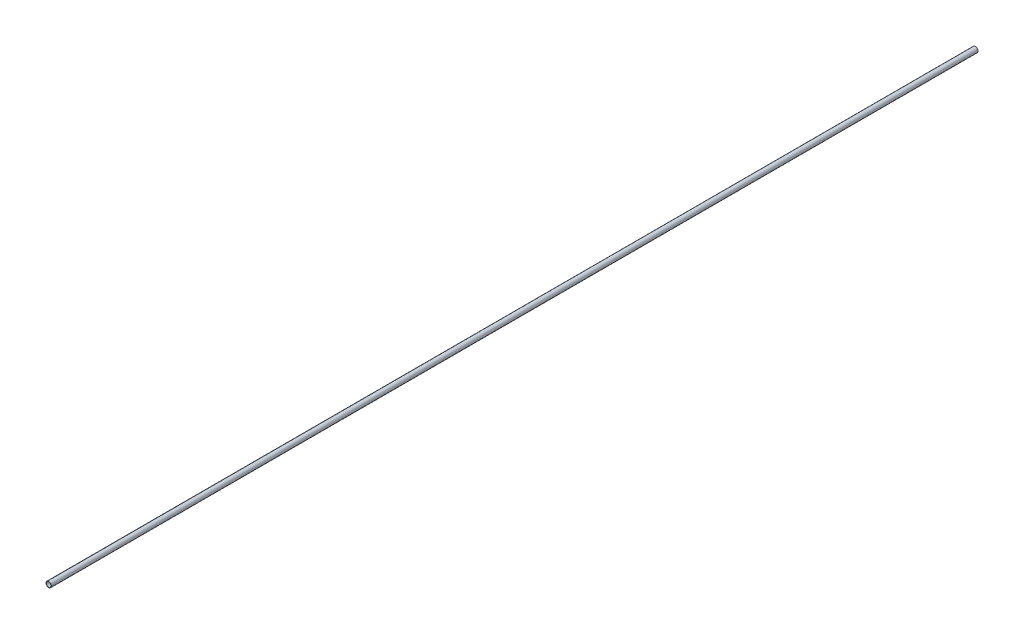
ISO-10303-21;
HEADER;
FILE_DESCRIPTION(('STEP AP214'),'2;1');
FILE_NAME('part.step','',(''),(''),'','','');
FILE_SCHEMA(('AUTOMOTIVE_DESIGN { 1 0 10303 214 1 1 1 1 }'));
ENDSEC;
DATA;
#1=APPLICATION_CONTEXT('core data for automotive mechanical design processes');
#2=APPLICATION_PROTOCOL_DEFINITION('international standard','automotive_design',2000,#1);
#3=PRODUCT_CONTEXT('',#1,'mechanical');
#4=PRODUCT('Part','Part','',(#3));
#5=PRODUCT_RELATED_PRODUCT_CATEGORY('part','',(#4));
#6=PRODUCT_DEFINITION_FORMATION('','',#4);
#7=PRODUCT_DEFINITION_CONTEXT('part definition',#1,'design');
#8=PRODUCT_DEFINITION('design','',#6,#7);
#9=PRODUCT_DEFINITION_SHAPE('','',#8);
#10=(LENGTH_UNIT() NAMED_UNIT(*) SI_UNIT(.MILLI.,.METRE.));
#11=(NAMED_UNIT(*) PLANE_ANGLE_UNIT() SI_UNIT($,.RADIAN.));
#12=(NAMED_UNIT(*) SI_UNIT($,.STERADIAN.) SOLID_ANGLE_UNIT());
#13=UNCERTAINTY_MEASURE_WITH_UNIT(LENGTH_MEASURE(1.E-05),#10,'distance_accuracy_value','');
#14=(GEOMETRIC_REPRESENTATION_CONTEXT(3) GLOBAL_UNCERTAINTY_ASSIGNED_CONTEXT((#13)) GLOBAL_UNIT_ASSIGNED_CONTEXT((#10,
#11,#12)) REPRESENTATION_CONTEXT('',''));
#15=CARTESIAN_POINT('',(0.,0.,0.));
#16=DIRECTION('',(0.,0.,1.));
#17=DIRECTION('',(1.,0.,0.));
#18=AXIS2_PLACEMENT_3D('',#15,#16,#17);
#19=CARTESIAN_POINT('',(0.,0.,2190.75));
#20=DIRECTION('',(0.,0.,1.));
#21=DIRECTION('',(1.,0.,0.));
#22=AXIS2_PLACEMENT_3D('',#19,#20,#21);
#23=PLANE('',#22);
#24=CARTESIAN_POINT('',(0.,0.,2190.75));
#25=DIRECTION('',(0.,0.,1.));
#26=DIRECTION('',(1.,0.,0.));
#27=AXIS2_PLACEMENT_3D('',#24,#25,#26);
#28=CIRCLE('',#27,6.35);
#29=CARTESIAN_POINT('',(6.35,0.,2190.75));
#30=VERTEX_POINT('',#29);
#31=EDGE_CURVE('E10',#30,#30,#28,.T.);
#32=ORIENTED_EDGE('',*,*,#31,.T.);
#33=EDGE_LOOP('',(#32));
#34=FACE_BOUND('',#33,.T.);
#35=CARTESIAN_POINT('',(0.,0.,2190.75));
#36=DIRECTION('',(0.,0.,1.));
#37=DIRECTION('',(1.,0.,0.));
#38=AXIS2_PLACEMENT_3D('',#35,#36,#37);
#39=CIRCLE('',#38,5.55625);
#40=CARTESIAN_POINT('',(5.55625,0.,2190.75));
#41=VERTEX_POINT('',#40);
#42=EDGE_CURVE('E41',#41,#41,#39,.T.);
#43=ORIENTED_EDGE('',*,*,#42,.F.);
#44=EDGE_LOOP('',(#43));
#45=FACE_BOUND('',#44,.T.);
#46=ADVANCED_FACE('F30',(#34,#45),#23,.T.);
#47=CARTESIAN_POINT('',(0.,0.,0.));
#48=DIRECTION('',(0.,0.,1.));
#49=DIRECTION('',(1.,0.,0.));
#50=AXIS2_PLACEMENT_3D('',#47,#48,#49);
#51=PLANE('',#50);
#52=CARTESIAN_POINT('',(0.,0.,0.));
#53=DIRECTION('',(0.,0.,1.));
#54=DIRECTION('',(1.,0.,0.));
#55=AXIS2_PLACEMENT_3D('',#52,#53,#54);
#56=CIRCLE('',#55,6.35);
#57=CARTESIAN_POINT('',(6.35,0.,0.));
#58=VERTEX_POINT('',#57);
#59=EDGE_CURVE('E34',#58,#58,#56,.T.);
#60=ORIENTED_EDGE('',*,*,#59,.F.);
#61=EDGE_LOOP('',(#60));
#62=FACE_BOUND('',#61,.T.);
#63=CARTESIAN_POINT('',(0.,0.,0.));
#64=DIRECTION('',(0.,0.,1.));
#65=DIRECTION('',(1.,0.,0.));
#66=AXIS2_PLACEMENT_3D('',#63,#64,#65);
#67=CIRCLE('',#66,5.55625);
#68=CARTESIAN_POINT('',(5.55625,0.,0.));
#69=VERTEX_POINT('',#68);
#70=EDGE_CURVE('E43',#69,#69,#67,.T.);
#71=ORIENTED_EDGE('',*,*,#70,.T.);
#72=EDGE_LOOP('',(#71));
#73=FACE_BOUND('',#72,.T.);
#74=ADVANCED_FACE('F53',(#62,#73),#51,.F.);
#75=CARTESIAN_POINT('',(0.,0.,2190.75));
#76=DIRECTION('',(0.,0.,-1.));
#77=DIRECTION('',(-1.,0.,0.));
#78=AXIS2_PLACEMENT_3D('',#75,#76,#77);
#79=CYLINDRICAL_SURFACE('',#78,6.35);
#80=ORIENTED_EDGE('',*,*,#31,.F.);
#81=EDGE_LOOP('',(#80));
#82=FACE_BOUND('',#81,.T.);
#83=ORIENTED_EDGE('',*,*,#59,.T.);
#84=EDGE_LOOP('',(#83));
#85=FACE_BOUND('',#84,.T.);
#86=ADVANCED_FACE('F32',(#82,#85),#79,.T.);
#87=CARTESIAN_POINT('',(0.,0.,2190.75));
#88=DIRECTION('',(0.,0.,-1.));
#89=DIRECTION('',(-1.,0.,0.));
#90=AXIS2_PLACEMENT_3D('',#87,#88,#89);
#91=CYLINDRICAL_SURFACE('',#90,5.55625);
#92=ORIENTED_EDGE('',*,*,#42,.T.);
#93=EDGE_LOOP('',(#92));
#94=FACE_BOUND('',#93,.T.);
#95=ORIENTED_EDGE('',*,*,#70,.F.);
#96=EDGE_LOOP('',(#95));
#97=FACE_BOUND('',#96,.T.);
#98=ADVANCED_FACE('F49',(#94,#97),#91,.F.);
#99=CLOSED_SHELL('',(#46,#74,#86,#98));
#100=MANIFOLD_SOLID_BREP('B2',#99);
#101=ADVANCED_BREP_SHAPE_REPRESENTATION('',(#18,#100),#14);
#102=SHAPE_DEFINITION_REPRESENTATION(#9,#101);
ENDSEC;
END-ISO-10303-21;
